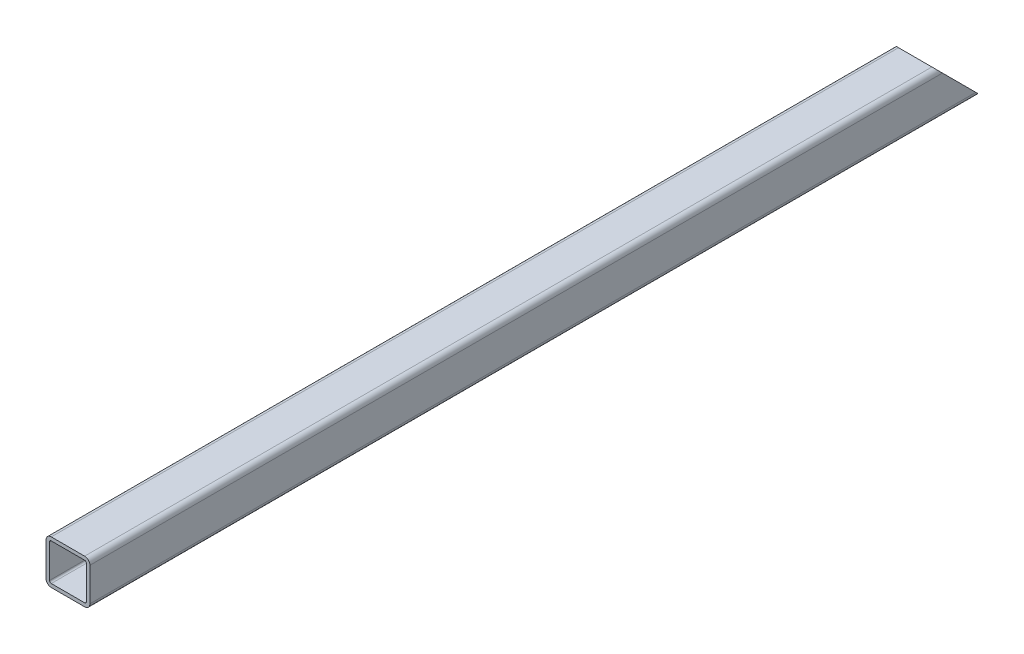
ISO-10303-21;
HEADER;
FILE_DESCRIPTION(('STEP AP214'),'2;1');
FILE_NAME('part.step','',(''),(''),'','','');
FILE_SCHEMA(('AUTOMOTIVE_DESIGN { 1 0 10303 214 1 1 1 1 }'));
ENDSEC;
DATA;
#1=APPLICATION_CONTEXT('core data for automotive mechanical design processes');
#2=APPLICATION_PROTOCOL_DEFINITION('international standard','automotive_design',2000,#1);
#3=PRODUCT_CONTEXT('',#1,'mechanical');
#4=PRODUCT('Part','Part','',(#3));
#5=PRODUCT_RELATED_PRODUCT_CATEGORY('part','',(#4));
#6=PRODUCT_DEFINITION_FORMATION('','',#4);
#7=PRODUCT_DEFINITION_CONTEXT('part definition',#1,'design');
#8=PRODUCT_DEFINITION('design','',#6,#7);
#9=PRODUCT_DEFINITION_SHAPE('','',#8);
#10=(LENGTH_UNIT() NAMED_UNIT(*) SI_UNIT(.MILLI.,.METRE.));
#11=(NAMED_UNIT(*) PLANE_ANGLE_UNIT() SI_UNIT($,.RADIAN.));
#12=(NAMED_UNIT(*) SI_UNIT($,.STERADIAN.) SOLID_ANGLE_UNIT());
#13=UNCERTAINTY_MEASURE_WITH_UNIT(LENGTH_MEASURE(1.E-05),#10,'distance_accuracy_value','');
#14=(GEOMETRIC_REPRESENTATION_CONTEXT(3) GLOBAL_UNCERTAINTY_ASSIGNED_CONTEXT((#13)) GLOBAL_UNIT_ASSIGNED_CONTEXT((#10,
#11,#12)) REPRESENTATION_CONTEXT('',''));
#15=CARTESIAN_POINT('',(0.,0.,0.));
#16=DIRECTION('',(0.,0.,1.));
#17=DIRECTION('',(1.,0.,0.));
#18=AXIS2_PLACEMENT_3D('',#15,#16,#17);
#19=CARTESIAN_POINT('',(0.,0.,495.));
#20=DIRECTION('',(0.,0.,1.));
#21=DIRECTION('',(1.,0.,0.));
#22=AXIS2_PLACEMENT_3D('',#19,#20,#21);
#23=PLANE('',#22);
#24=DIRECTION('',(0.,1.,0.));
#25=VECTOR('',#24,1.);
#26=CARTESIAN_POINT('',(-12.5,-4.75,495.));
#27=LINE('',#26,#25);
#28=CARTESIAN_POINT('',(-12.5,-9.5,495.));
#29=VERTEX_POINT('',#28);
#30=CARTESIAN_POINT('',(-12.5,9.5,495.));
#31=VERTEX_POINT('',#30);
#32=EDGE_CURVE('E297',#29,#31,#27,.T.);
#33=ORIENTED_EDGE('',*,*,#32,.F.);
#34=CARTESIAN_POINT('',(-9.5,-9.5,495.));
#35=DIRECTION('',(0.,0.,-1.));
#36=DIRECTION('',(1.,0.,0.));
#37=AXIS2_PLACEMENT_3D('',#34,#35,#36);
#38=CIRCLE('',#37,3.);
#39=CARTESIAN_POINT('',(-9.5,-12.5,495.));
#40=VERTEX_POINT('',#39);
#41=EDGE_CURVE('E164',#40,#29,#38,.T.);
#42=ORIENTED_EDGE('',*,*,#41,.F.);
#43=DIRECTION('',(-1.,0.,0.));
#44=VECTOR('',#43,1.);
#45=CARTESIAN_POINT('',(4.75,-12.5,495.));
#46=LINE('',#45,#44);
#47=CARTESIAN_POINT('',(9.5,-12.5,495.));
#48=VERTEX_POINT('',#47);
#49=EDGE_CURVE('E157',#48,#40,#46,.T.);
#50=ORIENTED_EDGE('',*,*,#49,.F.);
#51=CARTESIAN_POINT('',(9.5,-9.5,495.));
#52=DIRECTION('',(0.,0.,-1.));
#53=DIRECTION('',(0.,1.,0.));
#54=AXIS2_PLACEMENT_3D('',#51,#52,#53);
#55=CIRCLE('',#54,3.);
#56=CARTESIAN_POINT('',(12.5,-9.5,495.));
#57=VERTEX_POINT('',#56);
#58=EDGE_CURVE('E162',#57,#48,#55,.T.);
#59=ORIENTED_EDGE('',*,*,#58,.F.);
#60=DIRECTION('',(0.,-1.,0.));
#61=VECTOR('',#60,1.);
#62=CARTESIAN_POINT('',(12.5,4.75,495.));
#63=LINE('',#62,#61);
#64=CARTESIAN_POINT('',(12.5,9.5,495.));
#65=VERTEX_POINT('',#64);
#66=EDGE_CURVE('E169',#65,#57,#63,.T.);
#67=ORIENTED_EDGE('',*,*,#66,.F.);
#68=CARTESIAN_POINT('',(9.5,9.5,495.));
#69=DIRECTION('',(0.,0.,-1.));
#70=DIRECTION('',(-1.,0.,0.));
#71=AXIS2_PLACEMENT_3D('',#68,#69,#70);
#72=CIRCLE('',#71,3.);
#73=CARTESIAN_POINT('',(9.5,12.5,495.));
#74=VERTEX_POINT('',#73);
#75=EDGE_CURVE('E11',#74,#65,#72,.T.);
#76=ORIENTED_EDGE('',*,*,#75,.F.);
#77=DIRECTION('',(1.,0.,0.));
#78=VECTOR('',#77,1.);
#79=CARTESIAN_POINT('',(-4.75,12.5,495.));
#80=LINE('',#79,#78);
#81=CARTESIAN_POINT('',(-9.5,12.5,495.));
#82=VERTEX_POINT('',#81);
#83=EDGE_CURVE('E230',#82,#74,#80,.T.);
#84=ORIENTED_EDGE('',*,*,#83,.F.);
#85=CARTESIAN_POINT('',(-9.5,9.5,495.));
#86=DIRECTION('',(0.,0.,-1.));
#87=DIRECTION('',(0.,-1.,0.));
#88=AXIS2_PLACEMENT_3D('',#85,#86,#87);
#89=CIRCLE('',#88,3.);
#90=EDGE_CURVE('E231',#31,#82,#89,.T.);
#91=ORIENTED_EDGE('',*,*,#90,.F.);
#92=EDGE_LOOP('',(#33,#42,#50,#59,#67,#76,#84,#91));
#93=FACE_BOUND('',#92,.T.);
#94=DIRECTION('',(-1.,0.,0.));
#95=VECTOR('',#94,1.);
#96=CARTESIAN_POINT('',(-4.75,10.5,495.));
#97=LINE('',#96,#95);
#98=CARTESIAN_POINT('',(9.5,10.5,495.));
#99=VERTEX_POINT('',#98);
#100=CARTESIAN_POINT('',(-9.5,10.5,495.));
#101=VERTEX_POINT('',#100);
#102=EDGE_CURVE('E201',#99,#101,#97,.T.);
#103=ORIENTED_EDGE('',*,*,#102,.F.);
#104=CARTESIAN_POINT('',(9.5,9.5,495.));
#105=DIRECTION('',(0.,0.,1.));
#106=DIRECTION('',(-1.,0.,0.));
#107=AXIS2_PLACEMENT_3D('',#104,#105,#106);
#108=CIRCLE('',#107,1.);
#109=CARTESIAN_POINT('',(10.5,9.5,495.));
#110=VERTEX_POINT('',#109);
#111=EDGE_CURVE('E287',#110,#99,#108,.T.);
#112=ORIENTED_EDGE('',*,*,#111,.F.);
#113=DIRECTION('',(0.,1.,0.));
#114=VECTOR('',#113,1.);
#115=CARTESIAN_POINT('',(10.5,4.75,495.));
#116=LINE('',#115,#114);
#117=CARTESIAN_POINT('',(10.5,-9.5,495.));
#118=VERTEX_POINT('',#117);
#119=EDGE_CURVE('E321',#118,#110,#116,.T.);
#120=ORIENTED_EDGE('',*,*,#119,.F.);
#121=CARTESIAN_POINT('',(9.5,-9.5,495.));
#122=DIRECTION('',(0.,0.,1.));
#123=DIRECTION('',(0.,1.,0.));
#124=AXIS2_PLACEMENT_3D('',#121,#122,#123);
#125=CIRCLE('',#124,1.);
#126=CARTESIAN_POINT('',(9.5,-10.5,495.));
#127=VERTEX_POINT('',#126);
#128=EDGE_CURVE('E311',#127,#118,#125,.T.);
#129=ORIENTED_EDGE('',*,*,#128,.F.);
#130=DIRECTION('',(1.,0.,0.));
#131=VECTOR('',#130,1.);
#132=CARTESIAN_POINT('',(4.75,-10.5,495.));
#133=LINE('',#132,#131);
#134=CARTESIAN_POINT('',(-9.5,-10.5,495.));
#135=VERTEX_POINT('',#134);
#136=EDGE_CURVE('E273',#135,#127,#133,.T.);
#137=ORIENTED_EDGE('',*,*,#136,.F.);
#138=CARTESIAN_POINT('',(-9.5,-9.5,495.));
#139=DIRECTION('',(0.,0.,1.));
#140=DIRECTION('',(1.,0.,0.));
#141=AXIS2_PLACEMENT_3D('',#138,#139,#140);
#142=CIRCLE('',#141,1.);
#143=CARTESIAN_POINT('',(-10.5,-9.5,495.));
#144=VERTEX_POINT('',#143);
#145=EDGE_CURVE('E221',#144,#135,#142,.T.);
#146=ORIENTED_EDGE('',*,*,#145,.F.);
#147=DIRECTION('',(0.,-1.,0.));
#148=VECTOR('',#147,1.);
#149=CARTESIAN_POINT('',(-10.5,-4.75,495.));
#150=LINE('',#149,#148);
#151=CARTESIAN_POINT('',(-10.5,9.5,495.));
#152=VERTEX_POINT('',#151);
#153=EDGE_CURVE('E226',#152,#144,#150,.T.);
#154=ORIENTED_EDGE('',*,*,#153,.F.);
#155=CARTESIAN_POINT('',(-9.5,9.5,495.));
#156=DIRECTION('',(0.,0.,1.));
#157=DIRECTION('',(0.,-1.,0.));
#158=AXIS2_PLACEMENT_3D('',#155,#156,#157);
#159=CIRCLE('',#158,1.);
#160=EDGE_CURVE('E237',#101,#152,#159,.T.);
#161=ORIENTED_EDGE('',*,*,#160,.F.);
#162=EDGE_LOOP('',(#103,#112,#120,#129,#137,#146,#154,#161));
#163=FACE_BOUND('',#162,.T.);
#164=ADVANCED_FACE('F16',(#93,#163),#23,.T.);
#165=CARTESIAN_POINT('',(9.5,9.5,0.));
#166=DIRECTION('',(0.,0.,1.));
#167=DIRECTION('',(-1.,0.,0.));
#168=AXIS2_PLACEMENT_3D('',#165,#166,#167);
#169=CYLINDRICAL_SURFACE('',#168,3.);
#170=CARTESIAN_POINT('',(9.5,9.5,9.5));
#171=DIRECTION('',(0.,-0.707106781186548,0.707106781186548));
#172=DIRECTION('',(0.,-0.707106781186548,-0.707106781186548));
#173=AXIS2_PLACEMENT_3D('',#170,#171,#172);
#174=ELLIPSE('',#173,4.24264068711929,3.);
#175=CARTESIAN_POINT('',(12.5,9.5,9.5));
#176=VERTEX_POINT('',#175);
#177=CARTESIAN_POINT('',(9.5,12.5,12.5));
#178=VERTEX_POINT('',#177);
#179=EDGE_CURVE('E202',#176,#178,#174,.T.);
#180=ORIENTED_EDGE('',*,*,#179,.T.);
#181=DIRECTION('',(0.,0.,-1.));
#182=VECTOR('',#181,1.);
#183=CARTESIAN_POINT('',(9.5,12.5,0.));
#184=LINE('',#183,#182);
#185=EDGE_CURVE('E26',#74,#178,#184,.T.);
#186=ORIENTED_EDGE('',*,*,#185,.F.);
#187=ORIENTED_EDGE('',*,*,#75,.T.);
#188=DIRECTION('',(0.,0.,-1.));
#189=VECTOR('',#188,1.);
#190=CARTESIAN_POINT('',(12.5,9.5,0.));
#191=LINE('',#190,#189);
#192=EDGE_CURVE('E197',#65,#176,#191,.T.);
#193=ORIENTED_EDGE('',*,*,#192,.T.);
#194=EDGE_LOOP('',(#180,#186,#187,#193));
#195=FACE_BOUND('',#194,.T.);
#196=ADVANCED_FACE('F361',(#195),#169,.T.);
#197=CARTESIAN_POINT('',(-9.5,12.5,0.));
#198=DIRECTION('',(0.,1.,0.));
#199=DIRECTION('',(1.,0.,0.));
#200=AXIS2_PLACEMENT_3D('',#197,#198,#199);
#201=PLANE('',#200);
#202=DIRECTION('',(-1.,0.,0.));
#203=VECTOR('',#202,1.);
#204=CARTESIAN_POINT('',(-4.75,12.5,12.5));
#205=LINE('',#204,#203);
#206=CARTESIAN_POINT('',(-9.5,12.5,12.5));
#207=VERTEX_POINT('',#206);
#208=EDGE_CURVE('E278',#178,#207,#205,.T.);
#209=ORIENTED_EDGE('',*,*,#208,.T.);
#210=DIRECTION('',(0.,0.,-1.));
#211=VECTOR('',#210,1.);
#212=CARTESIAN_POINT('',(-9.5,12.5,0.));
#213=LINE('',#212,#211);
#214=EDGE_CURVE('E227',#82,#207,#213,.T.);
#215=ORIENTED_EDGE('',*,*,#214,.F.);
#216=ORIENTED_EDGE('',*,*,#83,.T.);
#217=ORIENTED_EDGE('',*,*,#185,.T.);
#218=EDGE_LOOP('',(#209,#215,#216,#217));
#219=FACE_BOUND('',#218,.T.);
#220=ADVANCED_FACE('F366',(#219),#201,.T.);
#221=CARTESIAN_POINT('',(-9.5,9.5,0.));
#222=DIRECTION('',(0.,0.,1.));
#223=DIRECTION('',(0.,-1.,0.));
#224=AXIS2_PLACEMENT_3D('',#221,#222,#223);
#225=CYLINDRICAL_SURFACE('',#224,3.);
#226=CARTESIAN_POINT('',(-9.5,9.5,9.5));
#227=DIRECTION('',(0.,-0.707106781186548,0.707106781186548));
#228=DIRECTION('',(0.,-0.707106781186548,-0.707106781186548));
#229=AXIS2_PLACEMENT_3D('',#226,#227,#228);
#230=ELLIPSE('',#229,4.24264068711929,3.);
#231=CARTESIAN_POINT('',(-12.5,9.5,9.5));
#232=VERTEX_POINT('',#231);
#233=EDGE_CURVE('E274',#207,#232,#230,.T.);
#234=ORIENTED_EDGE('',*,*,#233,.T.);
#235=DIRECTION('',(0.,0.,-1.));
#236=VECTOR('',#235,1.);
#237=CARTESIAN_POINT('',(-12.5,9.5,0.));
#238=LINE('',#237,#236);
#239=EDGE_CURVE('E286',#31,#232,#238,.T.);
#240=ORIENTED_EDGE('',*,*,#239,.F.);
#241=ORIENTED_EDGE('',*,*,#90,.T.);
#242=ORIENTED_EDGE('',*,*,#214,.T.);
#243=EDGE_LOOP('',(#234,#240,#241,#242));
#244=FACE_BOUND('',#243,.T.);
#245=ADVANCED_FACE('F369',(#244),#225,.T.);
#246=CARTESIAN_POINT('',(-9.5,9.5,0.));
#247=DIRECTION('',(0.,0.,1.));
#248=DIRECTION('',(0.,-1.,0.));
#249=AXIS2_PLACEMENT_3D('',#246,#247,#248);
#250=CYLINDRICAL_SURFACE('',#249,1.);
#251=CARTESIAN_POINT('',(-9.5,9.5,9.5));
#252=DIRECTION('',(0.,0.707106781186548,-0.707106781186547));
#253=DIRECTION('',(0.,-0.707106781186547,-0.707106781186548));
#254=AXIS2_PLACEMENT_3D('',#251,#252,#253);
#255=ELLIPSE('',#254,1.4142135623731,1.);
#256=CARTESIAN_POINT('',(-10.5,9.5,9.5));
#257=VERTEX_POINT('',#256);
#258=CARTESIAN_POINT('',(-9.5,10.5,10.5));
#259=VERTEX_POINT('',#258);
#260=EDGE_CURVE('E244',#257,#259,#255,.T.);
#261=ORIENTED_EDGE('',*,*,#260,.T.);
#262=DIRECTION('',(0.,0.,-1.));
#263=VECTOR('',#262,1.);
#264=CARTESIAN_POINT('',(-9.5,10.5,0.));
#265=LINE('',#264,#263);
#266=EDGE_CURVE('E215',#101,#259,#265,.T.);
#267=ORIENTED_EDGE('',*,*,#266,.F.);
#268=ORIENTED_EDGE('',*,*,#160,.T.);
#269=DIRECTION('',(0.,0.,1.));
#270=VECTOR('',#269,1.);
#271=CARTESIAN_POINT('',(-10.5,9.5,0.));
#272=LINE('',#271,#270);
#273=EDGE_CURVE('E222',#257,#152,#272,.T.);
#274=ORIENTED_EDGE('',*,*,#273,.F.);
#275=EDGE_LOOP('',(#261,#267,#268,#274));
#276=FACE_BOUND('',#275,.T.);
#277=ADVANCED_FACE('F397',(#276),#250,.F.);
#278=CARTESIAN_POINT('',(-10.5,-9.5,0.));
#279=DIRECTION('',(-1.,0.,0.));
#280=DIRECTION('',(0.,0.,1.));
#281=AXIS2_PLACEMENT_3D('',#278,#279,#280);
#282=PLANE('',#281);
#283=DIRECTION('',(0.,0.707106781186547,0.707106781186548));
#284=VECTOR('',#283,1.);
#285=CARTESIAN_POINT('',(-10.5,-2.375,-2.375));
#286=LINE('',#285,#284);
#287=CARTESIAN_POINT('',(-10.5,-9.5,-9.5));
#288=VERTEX_POINT('',#287);
#289=EDGE_CURVE('E211',#288,#257,#286,.T.);
#290=ORIENTED_EDGE('',*,*,#289,.T.);
#291=ORIENTED_EDGE('',*,*,#273,.T.);
#292=ORIENTED_EDGE('',*,*,#153,.T.);
#293=DIRECTION('',(0.,0.,-1.));
#294=VECTOR('',#293,1.);
#295=CARTESIAN_POINT('',(-10.5,-9.5,0.));
#296=LINE('',#295,#294);
#297=EDGE_CURVE('E168',#144,#288,#296,.T.);
#298=ORIENTED_EDGE('',*,*,#297,.T.);
#299=EDGE_LOOP('',(#290,#291,#292,#298));
#300=FACE_BOUND('',#299,.T.);
#301=ADVANCED_FACE('F393',(#300),#282,.F.);
#302=CARTESIAN_POINT('',(-9.5,-9.5,0.));
#303=DIRECTION('',(0.,0.,1.));
#304=DIRECTION('',(1.,0.,0.));
#305=AXIS2_PLACEMENT_3D('',#302,#303,#304);
#306=CYLINDRICAL_SURFACE('',#305,1.);
#307=CARTESIAN_POINT('',(-9.5,-9.5,-9.5));
#308=DIRECTION('',(0.,0.707106781186548,-0.707106781186547));
#309=DIRECTION('',(0.,0.707106781186547,0.707106781186548));
#310=AXIS2_PLACEMENT_3D('',#307,#308,#309);
#311=ELLIPSE('',#310,1.4142135623731,1.);
#312=CARTESIAN_POINT('',(-9.5,-10.5,-10.5));
#313=VERTEX_POINT('',#312);
#314=EDGE_CURVE('E207',#313,#288,#311,.T.);
#315=ORIENTED_EDGE('',*,*,#314,.T.);
#316=ORIENTED_EDGE('',*,*,#297,.F.);
#317=ORIENTED_EDGE('',*,*,#145,.T.);
#318=DIRECTION('',(0.,0.,-1.));
#319=VECTOR('',#318,1.);
#320=CARTESIAN_POINT('',(-9.5,-10.5,0.));
#321=LINE('',#320,#319);
#322=EDGE_CURVE('E180',#135,#313,#321,.T.);
#323=ORIENTED_EDGE('',*,*,#322,.T.);
#324=EDGE_LOOP('',(#315,#316,#317,#323));
#325=FACE_BOUND('',#324,.T.);
#326=ADVANCED_FACE('F396',(#325),#306,.F.);
#327=CARTESIAN_POINT('',(9.5,-12.5,0.));
#328=DIRECTION('',(0.,-1.,0.));
#329=DIRECTION('',(0.,0.,-1.));
#330=AXIS2_PLACEMENT_3D('',#327,#328,#329);
#331=PLANE('',#330);
#332=ORIENTED_EDGE('',*,*,#49,.T.);
#333=DIRECTION('',(0.,0.,1.));
#334=VECTOR('',#333,1.);
#335=CARTESIAN_POINT('',(-9.5,-12.5,0.));
#336=LINE('',#335,#334);
#337=CARTESIAN_POINT('',(-9.5,-12.5,-12.5000001));
#338=VERTEX_POINT('',#337);
#339=EDGE_CURVE('E283',#338,#40,#336,.T.);
#340=ORIENTED_EDGE('',*,*,#339,.F.);
#341=DIRECTION('',(-1.,0.,0.));
#342=VECTOR('',#341,1.);
#343=CARTESIAN_POINT('',(4.75,-12.5,-12.5000001));
#344=LINE('',#343,#342);
#345=CARTESIAN_POINT('',(9.5,-12.5,-12.5000001));
#346=VERTEX_POINT('',#345);
#347=EDGE_CURVE('E175',#346,#338,#344,.T.);
#348=ORIENTED_EDGE('',*,*,#347,.F.);
#349=DIRECTION('',(0.,0.,-1.));
#350=VECTOR('',#349,1.);
#351=CARTESIAN_POINT('',(9.5,-12.5,0.));
#352=LINE('',#351,#350);
#353=EDGE_CURVE('E172',#48,#346,#352,.T.);
#354=ORIENTED_EDGE('',*,*,#353,.F.);
#355=EDGE_LOOP('',(#332,#340,#348,#354));
#356=FACE_BOUND('',#355,.T.);
#357=ADVANCED_FACE('F173',(#356),#331,.T.);
#358=CARTESIAN_POINT('',(12.5,9.5,0.));
#359=DIRECTION('',(1.,0.,0.));
#360=DIRECTION('',(0.,1.,0.));
#361=AXIS2_PLACEMENT_3D('',#358,#359,#360);
#362=PLANE('',#361);
#363=DIRECTION('',(0.,0.707106781186547,0.707106781186548));
#364=VECTOR('',#363,1.);
#365=CARTESIAN_POINT('',(12.5,2.375,2.375));
#366=LINE('',#365,#364);
#367=CARTESIAN_POINT('',(12.5,-9.5,-9.5));
#368=VERTEX_POINT('',#367);
#369=EDGE_CURVE('E206',#368,#176,#366,.T.);
#370=ORIENTED_EDGE('',*,*,#369,.T.);
#371=ORIENTED_EDGE('',*,*,#192,.F.);
#372=ORIENTED_EDGE('',*,*,#66,.T.);
#373=DIRECTION('',(0.,0.,-1.));
#374=VECTOR('',#373,1.);
#375=CARTESIAN_POINT('',(12.5,-9.5,0.));
#376=LINE('',#375,#374);
#377=EDGE_CURVE('E184',#57,#368,#376,.T.);
#378=ORIENTED_EDGE('',*,*,#377,.T.);
#379=EDGE_LOOP('',(#370,#371,#372,#378));
#380=FACE_BOUND('',#379,.T.);
#381=ADVANCED_FACE('F358',(#380),#362,.T.);
#382=CARTESIAN_POINT('',(9.5,-10.5,0.));
#383=DIRECTION('',(0.,-1.,0.));
#384=DIRECTION('',(0.,0.,-1.));
#385=AXIS2_PLACEMENT_3D('',#382,#383,#384);
#386=PLANE('',#385);
#387=DIRECTION('',(-1.,0.,0.));
#388=VECTOR('',#387,1.);
#389=CARTESIAN_POINT('',(4.75,-10.5,-10.5));
#390=LINE('',#389,#388);
#391=CARTESIAN_POINT('',(9.5,-10.5,-10.5));
#392=VERTEX_POINT('',#391);
#393=EDGE_CURVE('E240',#392,#313,#390,.T.);
#394=ORIENTED_EDGE('',*,*,#393,.T.);
#395=ORIENTED_EDGE('',*,*,#322,.F.);
#396=ORIENTED_EDGE('',*,*,#136,.T.);
#397=DIRECTION('',(0.,0.,-1.));
#398=VECTOR('',#397,1.);
#399=CARTESIAN_POINT('',(9.5,-10.5,0.));
#400=LINE('',#399,#398);
#401=EDGE_CURVE('E333',#127,#392,#400,.T.);
#402=ORIENTED_EDGE('',*,*,#401,.T.);
#403=EDGE_LOOP('',(#394,#395,#396,#402));
#404=FACE_BOUND('',#403,.T.);
#405=ADVANCED_FACE('F439',(#404),#386,.F.);
#406=CARTESIAN_POINT('',(9.5,-9.5,0.));
#407=DIRECTION('',(0.,0.,1.));
#408=DIRECTION('',(0.,1.,0.));
#409=AXIS2_PLACEMENT_3D('',#406,#407,#408);
#410=CYLINDRICAL_SURFACE('',#409,3.);
#411=CARTESIAN_POINT('',(9.5,-9.5,-9.5));
#412=DIRECTION('',(0.,-0.707106781186548,0.707106781186548));
#413=DIRECTION('',(0.,0.707106781186548,0.707106781186548));
#414=AXIS2_PLACEMENT_3D('',#411,#412,#413);
#415=ELLIPSE('',#414,4.24264068711929,3.);
#416=EDGE_CURVE('E203',#346,#368,#415,.T.);
#417=ORIENTED_EDGE('',*,*,#416,.T.);
#418=ORIENTED_EDGE('',*,*,#377,.F.);
#419=ORIENTED_EDGE('',*,*,#58,.T.);
#420=ORIENTED_EDGE('',*,*,#353,.T.);
#421=EDGE_LOOP('',(#417,#418,#419,#420));
#422=FACE_BOUND('',#421,.T.);
#423=ADVANCED_FACE('F182',(#422),#410,.T.);
#424=CARTESIAN_POINT('',(-9.5,-9.5,0.));
#425=DIRECTION('',(0.,0.,1.));
#426=DIRECTION('',(1.,0.,0.));
#427=AXIS2_PLACEMENT_3D('',#424,#425,#426);
#428=CYLINDRICAL_SURFACE('',#427,3.);
#429=CARTESIAN_POINT('',(-9.5,-9.5,-9.5));
#430=DIRECTION('',(0.,-0.707106781186548,0.707106781186548));
#431=DIRECTION('',(0.,0.707106781186548,0.707106781186548));
#432=AXIS2_PLACEMENT_3D('',#429,#430,#431);
#433=ELLIPSE('',#432,4.24264068711929,3.);
#434=CARTESIAN_POINT('',(-12.5,-9.5,-9.5));
#435=VERTEX_POINT('',#434);
#436=EDGE_CURVE('E308',#435,#338,#433,.T.);
#437=ORIENTED_EDGE('',*,*,#436,.T.);
#438=ORIENTED_EDGE('',*,*,#339,.T.);
#439=ORIENTED_EDGE('',*,*,#41,.T.);
#440=DIRECTION('',(0.,0.,-1.));
#441=VECTOR('',#440,1.);
#442=CARTESIAN_POINT('',(-12.5,-9.5,0.));
#443=LINE('',#442,#441);
#444=EDGE_CURVE('E301',#29,#435,#443,.T.);
#445=ORIENTED_EDGE('',*,*,#444,.T.);
#446=EDGE_LOOP('',(#437,#438,#439,#445));
#447=FACE_BOUND('',#446,.T.);
#448=ADVANCED_FACE('F347',(#447),#428,.T.);
#449=CARTESIAN_POINT('',(-12.5,-9.5,0.));
#450=DIRECTION('',(-1.,0.,0.));
#451=DIRECTION('',(0.,1.,0.));
#452=AXIS2_PLACEMENT_3D('',#449,#450,#451);
#453=PLANE('',#452);
#454=DIRECTION('',(0.,-0.707106781186548,-0.707106781186548));
#455=VECTOR('',#454,1.);
#456=CARTESIAN_POINT('',(-12.5,-2.375,-2.375));
#457=LINE('',#456,#455);
#458=EDGE_CURVE('E279',#232,#435,#457,.T.);
#459=ORIENTED_EDGE('',*,*,#458,.T.);
#460=ORIENTED_EDGE('',*,*,#444,.F.);
#461=ORIENTED_EDGE('',*,*,#32,.T.);
#462=ORIENTED_EDGE('',*,*,#239,.T.);
#463=EDGE_LOOP('',(#459,#460,#461,#462));
#464=FACE_BOUND('',#463,.T.);
#465=ADVANCED_FACE('F371',(#464),#453,.T.);
#466=CARTESIAN_POINT('',(9.5,-9.5,0.));
#467=DIRECTION('',(0.,0.,1.));
#468=DIRECTION('',(0.,1.,0.));
#469=AXIS2_PLACEMENT_3D('',#466,#467,#468);
#470=CYLINDRICAL_SURFACE('',#469,1.);
#471=CARTESIAN_POINT('',(9.5,-9.5,-9.5));
#472=DIRECTION('',(0.,0.707106781186548,-0.707106781186547));
#473=DIRECTION('',(0.,0.707106781186547,0.707106781186548));
#474=AXIS2_PLACEMENT_3D('',#471,#472,#473);
#475=ELLIPSE('',#474,1.4142135623731,1.);
#476=CARTESIAN_POINT('',(10.5,-9.5,-9.5));
#477=VERTEX_POINT('',#476);
#478=EDGE_CURVE('E243',#477,#392,#475,.T.);
#479=ORIENTED_EDGE('',*,*,#478,.T.);
#480=ORIENTED_EDGE('',*,*,#401,.F.);
#481=ORIENTED_EDGE('',*,*,#128,.T.);
#482=DIRECTION('',(0.,0.,-1.));
#483=VECTOR('',#482,1.);
#484=CARTESIAN_POINT('',(10.5,-9.5,0.));
#485=LINE('',#484,#483);
#486=EDGE_CURVE('E289',#118,#477,#485,.T.);
#487=ORIENTED_EDGE('',*,*,#486,.T.);
#488=EDGE_LOOP('',(#479,#480,#481,#487));
#489=FACE_BOUND('',#488,.T.);
#490=ADVANCED_FACE('F18',(#489),#470,.F.);
#491=CARTESIAN_POINT('',(10.5,9.5,0.));
#492=DIRECTION('',(1.,0.,0.));
#493=DIRECTION('',(0.,-1.,0.));
#494=AXIS2_PLACEMENT_3D('',#491,#492,#493);
#495=PLANE('',#494);
#496=DIRECTION('',(0.,-0.707106781186548,-0.707106781186548));
#497=VECTOR('',#496,1.);
#498=CARTESIAN_POINT('',(10.5,2.375,2.375));
#499=LINE('',#498,#497);
#500=CARTESIAN_POINT('',(10.5,9.5,9.5));
#501=VERTEX_POINT('',#500);
#502=EDGE_CURVE('E268',#501,#477,#499,.T.);
#503=ORIENTED_EDGE('',*,*,#502,.T.);
#504=ORIENTED_EDGE('',*,*,#486,.F.);
#505=ORIENTED_EDGE('',*,*,#119,.T.);
#506=DIRECTION('',(0.,0.,-1.));
#507=VECTOR('',#506,1.);
#508=CARTESIAN_POINT('',(10.5,9.5,0.));
#509=LINE('',#508,#507);
#510=EDGE_CURVE('E218',#110,#501,#509,.T.);
#511=ORIENTED_EDGE('',*,*,#510,.T.);
#512=EDGE_LOOP('',(#503,#504,#505,#511));
#513=FACE_BOUND('',#512,.T.);
#514=ADVANCED_FACE('F379',(#513),#495,.F.);
#515=CARTESIAN_POINT('',(9.5,9.5,0.));
#516=DIRECTION('',(0.,0.,1.));
#517=DIRECTION('',(-1.,0.,0.));
#518=AXIS2_PLACEMENT_3D('',#515,#516,#517);
#519=CYLINDRICAL_SURFACE('',#518,1.);
#520=CARTESIAN_POINT('',(9.5,9.5,9.5));
#521=DIRECTION('',(0.,0.707106781186548,-0.707106781186547));
#522=DIRECTION('',(0.,-0.707106781186547,-0.707106781186548));
#523=AXIS2_PLACEMENT_3D('',#520,#521,#522);
#524=ELLIPSE('',#523,1.4142135623731,1.);
#525=CARTESIAN_POINT('',(9.5,10.5,10.5));
#526=VERTEX_POINT('',#525);
#527=EDGE_CURVE('E259',#526,#501,#524,.T.);
#528=ORIENTED_EDGE('',*,*,#527,.T.);
#529=ORIENTED_EDGE('',*,*,#510,.F.);
#530=ORIENTED_EDGE('',*,*,#111,.T.);
#531=DIRECTION('',(0.,0.,-1.));
#532=VECTOR('',#531,1.);
#533=CARTESIAN_POINT('',(9.5,10.5,0.));
#534=LINE('',#533,#532);
#535=EDGE_CURVE('E198',#99,#526,#534,.T.);
#536=ORIENTED_EDGE('',*,*,#535,.T.);
#537=EDGE_LOOP('',(#528,#529,#530,#536));
#538=FACE_BOUND('',#537,.T.);
#539=ADVANCED_FACE('F402',(#538),#519,.F.);
#540=CARTESIAN_POINT('',(-9.5,10.5,0.));
#541=DIRECTION('',(0.,1.,0.));
#542=DIRECTION('',(1.,0.,0.));
#543=AXIS2_PLACEMENT_3D('',#540,#541,#542);
#544=PLANE('',#543);
#545=DIRECTION('',(1.,0.,0.));
#546=VECTOR('',#545,1.);
#547=CARTESIAN_POINT('',(-4.75,10.5,10.5));
#548=LINE('',#547,#546);
#549=EDGE_CURVE('E247',#259,#526,#548,.T.);
#550=ORIENTED_EDGE('',*,*,#549,.T.);
#551=ORIENTED_EDGE('',*,*,#535,.F.);
#552=ORIENTED_EDGE('',*,*,#102,.T.);
#553=ORIENTED_EDGE('',*,*,#266,.T.);
#554=EDGE_LOOP('',(#550,#551,#552,#553));
#555=FACE_BOUND('',#554,.T.);
#556=ADVANCED_FACE('F399',(#555),#544,.F.);
#557=CARTESIAN_POINT('',(0.,0.,0.));
#558=DIRECTION('',(0.,-0.707106781186548,0.707106781186547));
#559=DIRECTION('',(-1.,0.,0.));
#560=AXIS2_PLACEMENT_3D('',#557,#558,#559);
#561=PLANE('',#560);
#562=ORIENTED_EDGE('',*,*,#369,.F.);
#563=ORIENTED_EDGE('',*,*,#416,.F.);
#564=ORIENTED_EDGE('',*,*,#347,.T.);
#565=ORIENTED_EDGE('',*,*,#436,.F.);
#566=ORIENTED_EDGE('',*,*,#458,.F.);
#567=ORIENTED_EDGE('',*,*,#233,.F.);
#568=ORIENTED_EDGE('',*,*,#208,.F.);
#569=ORIENTED_EDGE('',*,*,#179,.F.);
#570=EDGE_LOOP('',(#562,#563,#564,#565,#566,#567,#568,#569));
#571=FACE_BOUND('',#570,.T.);
#572=ORIENTED_EDGE('',*,*,#393,.F.);
#573=ORIENTED_EDGE('',*,*,#478,.F.);
#574=ORIENTED_EDGE('',*,*,#502,.F.);
#575=ORIENTED_EDGE('',*,*,#527,.F.);
#576=ORIENTED_EDGE('',*,*,#549,.F.);
#577=ORIENTED_EDGE('',*,*,#260,.F.);
#578=ORIENTED_EDGE('',*,*,#289,.F.);
#579=ORIENTED_EDGE('',*,*,#314,.F.);
#580=EDGE_LOOP('',(#572,#573,#574,#575,#576,#577,#578,#579));
#581=FACE_BOUND('',#580,.T.);
#582=ADVANCED_FACE('F352',(#571,#581),#561,.F.);
#583=CLOSED_SHELL('',(#164,#196,#220,#245,#277,#301,#326,#357,#381,#405,#423,#448,#465,#490,
#514,#539,#556,#582));
#584=MANIFOLD_SOLID_BREP('B1',#583);
#585=ADVANCED_BREP_SHAPE_REPRESENTATION('',(#18,#584),#14);
#586=SHAPE_DEFINITION_REPRESENTATION(#9,#585);
ENDSEC;
END-ISO-10303-21;
